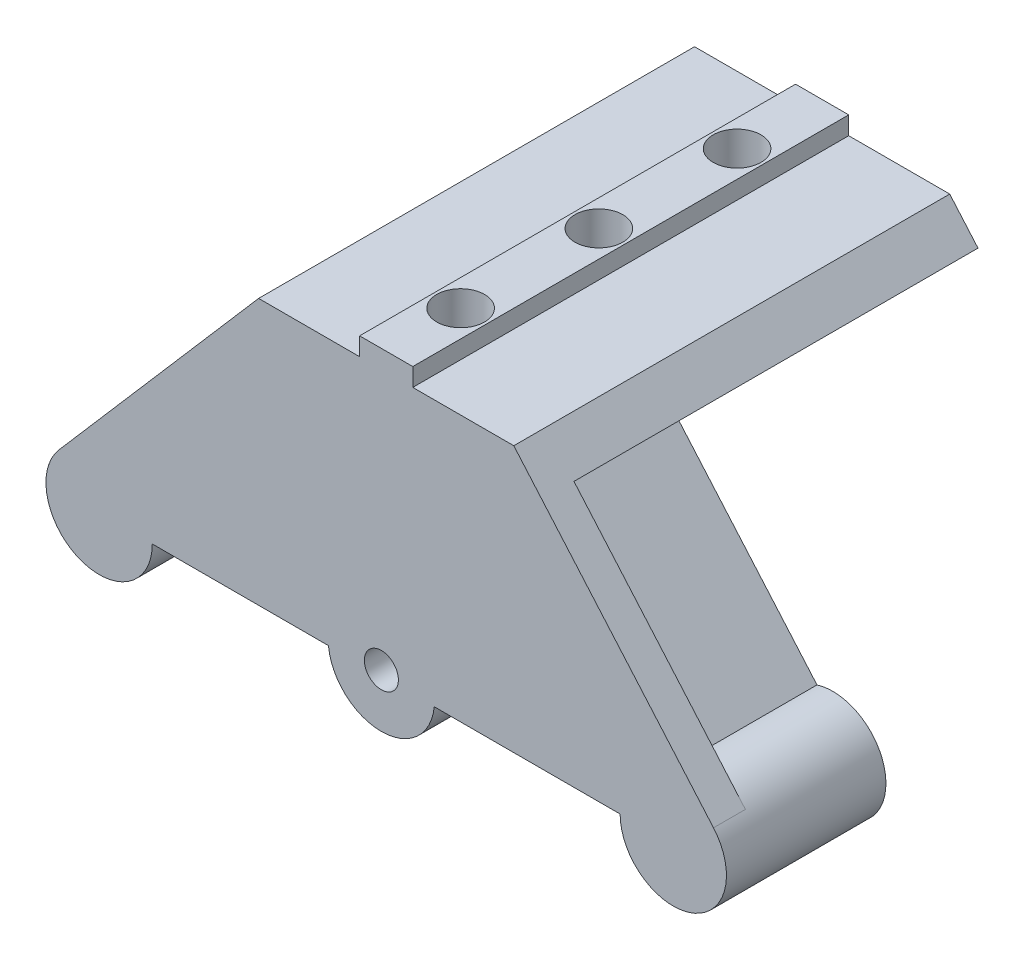
ISO-10303-21;
HEADER;
FILE_DESCRIPTION(('STEP AP214'),'2;1');
FILE_NAME('part.step','',(''),(''),'','','');
FILE_SCHEMA(('AUTOMOTIVE_DESIGN { 1 0 10303 214 1 1 1 1 }'));
ENDSEC;
DATA;
#1=APPLICATION_CONTEXT('core data for automotive mechanical design processes');
#2=APPLICATION_PROTOCOL_DEFINITION('international standard','automotive_design',2000,#1);
#3=PRODUCT_CONTEXT('',#1,'mechanical');
#4=PRODUCT('Part','Part','',(#3));
#5=PRODUCT_RELATED_PRODUCT_CATEGORY('part','',(#4));
#6=PRODUCT_DEFINITION_FORMATION('','',#4);
#7=PRODUCT_DEFINITION_CONTEXT('part definition',#1,'design');
#8=PRODUCT_DEFINITION('design','',#6,#7);
#9=PRODUCT_DEFINITION_SHAPE('','',#8);
#10=(LENGTH_UNIT() NAMED_UNIT(*) SI_UNIT(.MILLI.,.METRE.));
#11=(NAMED_UNIT(*) PLANE_ANGLE_UNIT() SI_UNIT($,.RADIAN.));
#12=(NAMED_UNIT(*) SI_UNIT($,.STERADIAN.) SOLID_ANGLE_UNIT());
#13=UNCERTAINTY_MEASURE_WITH_UNIT(LENGTH_MEASURE(1.E-05),#10,'distance_accuracy_value','');
#14=(GEOMETRIC_REPRESENTATION_CONTEXT(3) GLOBAL_UNCERTAINTY_ASSIGNED_CONTEXT((#13)) GLOBAL_UNIT_ASSIGNED_CONTEXT((#10,
#11,#12)) REPRESENTATION_CONTEXT('',''));
#15=CARTESIAN_POINT('',(0.,0.,0.));
#16=DIRECTION('',(0.,0.,1.));
#17=DIRECTION('',(1.,0.,0.));
#18=AXIS2_PLACEMENT_3D('',#15,#16,#17);
#19=CARTESIAN_POINT('',(-22.,0.,-3.));
#20=DIRECTION('',(0.,-1.,0.));
#21=DIRECTION('',(0.,0.,-1.));
#22=AXIS2_PLACEMENT_3D('',#19,#20,#21);
#23=PLANE('',#22);
#24=DIRECTION('',(0.,0.,1.));
#25=VECTOR('',#24,1.);
#26=CARTESIAN_POINT('',(4.51976416023808,0.,-3.));
#27=LINE('',#26,#25);
#28=CARTESIAN_POINT('',(4.51976416023808,0.,-3.));
#29=VERTEX_POINT('',#28);
#30=CARTESIAN_POINT('',(4.51976416023808,0.,0.));
#31=VERTEX_POINT('',#30);
#32=EDGE_CURVE('E200',#29,#31,#27,.T.);
#33=ORIENTED_EDGE('',*,*,#32,.F.);
#34=DIRECTION('',(1.,0.,0.));
#35=VECTOR('',#34,1.);
#36=CARTESIAN_POINT('',(-22.,0.,-3.));
#37=LINE('',#36,#35);
#38=CARTESIAN_POINT('',(22.,0.,-3.));
#39=VERTEX_POINT('',#38);
#40=EDGE_CURVE('E37',#29,#39,#37,.T.);
#41=ORIENTED_EDGE('',*,*,#40,.T.);
#42=DIRECTION('',(0.,0.,1.));
#43=VECTOR('',#42,1.);
#44=CARTESIAN_POINT('',(22.,0.,-3.));
#45=LINE('',#44,#43);
#46=CARTESIAN_POINT('',(22.,0.,0.));
#47=VERTEX_POINT('',#46);
#48=EDGE_CURVE('E229',#39,#47,#45,.T.);
#49=ORIENTED_EDGE('',*,*,#48,.T.);
#50=DIRECTION('',(1.,0.,0.));
#51=VECTOR('',#50,1.);
#52=CARTESIAN_POINT('',(-22.,0.,0.));
#53=LINE('',#52,#51);
#54=EDGE_CURVE('E267',#31,#47,#53,.T.);
#55=ORIENTED_EDGE('',*,*,#54,.F.);
#56=EDGE_LOOP('',(#33,#41,#49,#55));
#57=FACE_BOUND('',#56,.T.);
#58=ADVANCED_FACE('F33',(#57),#23,.T.);
#59=CARTESIAN_POINT('',(0.,12.,-7.));
#60=DIRECTION('',(0.,1.,0.));
#61=DIRECTION('',(0.,0.,1.));
#62=AXIS2_PLACEMENT_3D('',#59,#60,#61);
#63=CYLINDRICAL_SURFACE('',#62,2.25);
#64=CARTESIAN_POINT('',(0.,26.7,-7.));
#65=DIRECTION('',(0.,1.,0.));
#66=DIRECTION('',(0.,0.,1.));
#67=AXIS2_PLACEMENT_3D('',#64,#65,#66);
#68=CIRCLE('',#67,2.25);
#69=CARTESIAN_POINT('',(0.,26.7,-4.75));
#70=VERTEX_POINT('',#69);
#71=EDGE_CURVE('E451',#70,#70,#68,.T.);
#72=ORIENTED_EDGE('',*,*,#71,.T.);
#73=EDGE_LOOP('',(#72));
#74=FACE_BOUND('',#73,.T.);
#75=CARTESIAN_POINT('',(0.,22.5,-7.));
#76=DIRECTION('',(0.,-1.,0.));
#77=DIRECTION('',(1.,0.,0.));
#78=AXIS2_PLACEMENT_3D('',#75,#76,#77);
#79=CIRCLE('',#78,2.25);
#80=CARTESIAN_POINT('',(2.25,22.5,-7.));
#81=VERTEX_POINT('',#80);
#82=EDGE_CURVE('E461',#81,#81,#79,.F.);
#83=ORIENTED_EDGE('',*,*,#82,.F.);
#84=EDGE_LOOP('',(#83));
#85=FACE_BOUND('',#84,.T.);
#86=ADVANCED_FACE('F568',(#74,#85),#63,.F.);
#87=CARTESIAN_POINT('',(0.,12.,-20.));
#88=DIRECTION('',(0.,1.,0.));
#89=DIRECTION('',(0.,0.,1.));
#90=AXIS2_PLACEMENT_3D('',#87,#88,#89);
#91=CYLINDRICAL_SURFACE('',#90,2.25);
#92=CARTESIAN_POINT('',(0.,26.7,-20.));
#93=DIRECTION('',(0.,1.,0.));
#94=DIRECTION('',(0.,0.,1.));
#95=AXIS2_PLACEMENT_3D('',#92,#93,#94);
#96=CIRCLE('',#95,2.25);
#97=CARTESIAN_POINT('',(0.,26.7,-17.75));
#98=VERTEX_POINT('',#97);
#99=EDGE_CURVE('E448',#98,#98,#96,.T.);
#100=ORIENTED_EDGE('',*,*,#99,.T.);
#101=EDGE_LOOP('',(#100));
#102=FACE_BOUND('',#101,.T.);
#103=CARTESIAN_POINT('',(0.,22.5,-20.));
#104=DIRECTION('',(0.,-1.,0.));
#105=DIRECTION('',(1.,0.,0.));
#106=AXIS2_PLACEMENT_3D('',#103,#104,#105);
#107=CIRCLE('',#106,2.25);
#108=CARTESIAN_POINT('',(2.25,22.5,-20.));
#109=VERTEX_POINT('',#108);
#110=EDGE_CURVE('E458',#109,#109,#107,.F.);
#111=ORIENTED_EDGE('',*,*,#110,.F.);
#112=EDGE_LOOP('',(#111));
#113=FACE_BOUND('',#112,.T.);
#114=ADVANCED_FACE('F573',(#102,#113),#91,.F.);
#115=CARTESIAN_POINT('',(0.,12.,-33.));
#116=DIRECTION('',(0.,1.,0.));
#117=DIRECTION('',(0.,0.,1.));
#118=AXIS2_PLACEMENT_3D('',#115,#116,#117);
#119=CYLINDRICAL_SURFACE('',#118,2.25);
#120=CARTESIAN_POINT('',(0.,26.7,-33.));
#121=DIRECTION('',(0.,1.,0.));
#122=DIRECTION('',(0.,0.,1.));
#123=AXIS2_PLACEMENT_3D('',#120,#121,#122);
#124=CIRCLE('',#123,2.25);
#125=CARTESIAN_POINT('',(0.,26.7,-30.75));
#126=VERTEX_POINT('',#125);
#127=EDGE_CURVE('E443',#126,#126,#124,.T.);
#128=ORIENTED_EDGE('',*,*,#127,.T.);
#129=EDGE_LOOP('',(#128));
#130=FACE_BOUND('',#129,.T.);
#131=CARTESIAN_POINT('',(0.,22.5,-33.));
#132=DIRECTION('',(0.,-1.,0.));
#133=DIRECTION('',(1.,0.,0.));
#134=AXIS2_PLACEMENT_3D('',#131,#132,#133);
#135=CIRCLE('',#134,2.25);
#136=CARTESIAN_POINT('',(2.25,22.5,-33.));
#137=VERTEX_POINT('',#136);
#138=EDGE_CURVE('E454',#137,#137,#135,.F.);
#139=ORIENTED_EDGE('',*,*,#138,.F.);
#140=EDGE_LOOP('',(#139));
#141=FACE_BOUND('',#140,.T.);
#142=ADVANCED_FACE('F660',(#130,#141),#119,.F.);
#143=CARTESIAN_POINT('',(-12.,25.,-3.));
#144=DIRECTION('',(0.,1.,0.));
#145=DIRECTION('',(0.,0.,1.));
#146=AXIS2_PLACEMENT_3D('',#143,#144,#145);
#147=PLANE('',#146);
#148=DIRECTION('',(-1.,0.,0.));
#149=VECTOR('',#148,1.);
#150=CARTESIAN_POINT('',(-12.,25.,0.));
#151=LINE('',#150,#149);
#152=CARTESIAN_POINT('',(-2.5,25.,0.));
#153=VERTEX_POINT('',#152);
#154=CARTESIAN_POINT('',(-12.,25.,0.));
#155=VERTEX_POINT('',#154);
#156=EDGE_CURVE('E277',#153,#155,#151,.T.);
#157=ORIENTED_EDGE('',*,*,#156,.F.);
#158=DIRECTION('',(0.,0.,-1.));
#159=VECTOR('',#158,1.);
#160=CARTESIAN_POINT('',(-2.5,25.,0.));
#161=LINE('',#160,#159);
#162=CARTESIAN_POINT('',(-2.5,25.,-41.));
#163=VERTEX_POINT('',#162);
#164=EDGE_CURVE('E414',#153,#163,#161,.T.);
#165=ORIENTED_EDGE('',*,*,#164,.T.);
#166=DIRECTION('',(1.,0.,0.));
#167=VECTOR('',#166,1.);
#168=CARTESIAN_POINT('',(-12.,25.,-41.));
#169=LINE('',#168,#167);
#170=CARTESIAN_POINT('',(-12.,25.,-41.));
#171=VERTEX_POINT('',#170);
#172=EDGE_CURVE('E546',#171,#163,#169,.T.);
#173=ORIENTED_EDGE('',*,*,#172,.F.);
#174=DIRECTION('',(0.,0.,1.));
#175=VECTOR('',#174,1.);
#176=CARTESIAN_POINT('',(-12.,25.,-3.));
#177=LINE('',#176,#175);
#178=EDGE_CURVE('E215',#171,#155,#177,.T.);
#179=ORIENTED_EDGE('',*,*,#178,.T.);
#180=EDGE_LOOP('',(#157,#165,#173,#179));
#181=FACE_BOUND('',#180,.T.);
#182=ADVANCED_FACE('F641',(#181),#147,.T.);
#183=CARTESIAN_POINT('',(-27.,0.,-15.));
#184=DIRECTION('',(0.,0.,-1.));
#185=DIRECTION('',(-1.,0.,0.));
#186=AXIS2_PLACEMENT_3D('',#183,#184,#185);
#187=PLANE('',#186);
#188=DIRECTION('',(-0.756553330373241,0.653931998223942,0.));
#189=VECTOR('',#188,1.);
#190=CARTESIAN_POINT('',(-14.6591141126405,21.9235919893436,-15.));
#191=LINE('',#190,#189);
#192=CARTESIAN_POINT('',(-10.1197941304011,18.,-15.));
#193=VERTEX_POINT('',#192);
#194=CARTESIAN_POINT('',(-12.3894541215208,19.9617959946718,-15.));
#195=VERTEX_POINT('',#194);
#196=EDGE_CURVE('E314',#193,#195,#191,.T.);
#197=ORIENTED_EDGE('',*,*,#196,.F.);
#198=DIRECTION('',(-0.653931998223943,-0.75655333037324,0.));
#199=VECTOR('',#198,1.);
#200=CARTESIAN_POINT('',(-23.0398472253722,3.05240724701143,-15.));
#201=LINE('',#200,#199);
#202=CARTESIAN_POINT('',(-23.0398472253722,3.05240724701143,-15.));
#203=VERTEX_POINT('',#202);
#204=EDGE_CURVE('E338',#193,#203,#201,.T.);
#205=ORIENTED_EDGE('',*,*,#204,.T.);
#206=CARTESIAN_POINT('',(-27.,0.,-15.));
#207=DIRECTION('',(0.,0.,-1.));
#208=DIRECTION('',(-1.,0.,0.));
#209=AXIS2_PLACEMENT_3D('',#206,#207,#208);
#210=CIRCLE('',#209,4.99999999999997);
#211=CARTESIAN_POINT('',(-25.5164137795315,4.77482690015417,-15.));
#212=VERTEX_POINT('',#211);
#213=EDGE_CURVE('E293',#203,#212,#210,.T.);
#214=ORIENTED_EDGE('',*,*,#213,.T.);
#215=DIRECTION('',(0.653931998223943,0.75655333037324,0.));
#216=VECTOR('',#215,1.);
#217=CARTESIAN_POINT('',(-25.5164137795315,4.77482690015417,-15.));
#218=LINE('',#217,#216);
#219=EDGE_CURVE('E291',#212,#195,#218,.T.);
#220=ORIENTED_EDGE('',*,*,#219,.T.);
#221=EDGE_LOOP('',(#197,#205,#214,#220));
#222=FACE_BOUND('',#221,.T.);
#223=CARTESIAN_POINT('',(-27.,0.,-15.));
#224=DIRECTION('',(0.,0.,-1.));
#225=DIRECTION('',(-1.,0.,0.));
#226=AXIS2_PLACEMENT_3D('',#223,#224,#225);
#227=CIRCLE('',#226,3.39);
#228=CARTESIAN_POINT('',(-30.39,0.,-15.));
#229=VERTEX_POINT('',#228);
#230=EDGE_CURVE('E329',#229,#229,#227,.T.);
#231=ORIENTED_EDGE('',*,*,#230,.F.);
#232=EDGE_LOOP('',(#231));
#233=FACE_BOUND('',#232,.T.);
#234=ADVANCED_FACE('F617',(#222,#233),#187,.T.);
#235=CARTESIAN_POINT('',(27.,0.,-3.));
#236=DIRECTION('',(0.,0.,1.));
#237=DIRECTION('',(1.,0.,0.));
#238=AXIS2_PLACEMENT_3D('',#235,#236,#237);
#239=PLANE('',#238);
#240=DIRECTION('',(-0.756553330373241,0.653931998223942,0.));
#241=VECTOR('',#240,1.);
#242=CARTESIAN_POINT('',(-12.3894541215208,19.9617959946718,-3.));
#243=LINE('',#242,#241);
#244=CARTESIAN_POINT('',(-12.3894541215208,19.9617959946718,-3.));
#245=VERTEX_POINT('',#244);
#246=CARTESIAN_POINT('',(-14.6591141126405,21.9235919893436,-3.));
#247=VERTEX_POINT('',#246);
#248=EDGE_CURVE('E299',#245,#247,#243,.T.);
#249=ORIENTED_EDGE('',*,*,#248,.F.);
#250=DIRECTION('',(0.653931998223943,0.75655333037324,0.));
#251=VECTOR('',#250,1.);
#252=CARTESIAN_POINT('',(-25.5164137795315,4.77482690015417,-3.));
#253=LINE('',#252,#251);
#254=CARTESIAN_POINT('',(-25.5164137795315,4.77482690015417,-3.));
#255=VERTEX_POINT('',#254);
#256=EDGE_CURVE('E352',#255,#245,#253,.T.);
#257=ORIENTED_EDGE('',*,*,#256,.F.);
#258=CARTESIAN_POINT('',(-27.,0.,-3.));
#259=DIRECTION('',(0.,0.,-1.));
#260=DIRECTION('',(-1.,0.,0.));
#261=AXIS2_PLACEMENT_3D('',#258,#259,#260);
#262=CIRCLE('',#261,4.99999999999997);
#263=CARTESIAN_POINT('',(-30.7827666518662,3.26965999111971,-3.));
#264=VERTEX_POINT('',#263);
#265=EDGE_CURVE('E43',#264,#255,#262,.T.);
#266=ORIENTED_EDGE('',*,*,#265,.F.);
#267=DIRECTION('',(-0.653931998223943,-0.75655333037324,0.));
#268=VECTOR('',#267,1.);
#269=CARTESIAN_POINT('',(-12.,25.,-3.));
#270=LINE('',#269,#268);
#271=EDGE_CURVE('E217',#247,#264,#270,.T.);
#272=ORIENTED_EDGE('',*,*,#271,.F.);
#273=EDGE_LOOP('',(#249,#257,#266,#272));
#274=FACE_BOUND('',#273,.T.);
#275=ADVANCED_FACE('F521',(#274),#239,.F.);
#276=CARTESIAN_POINT('',(-0.45563994772233,0.495332173890094,-3.));
#277=DIRECTION('',(0.,0.,1.));
#278=DIRECTION('',(1.,0.,0.));
#279=AXIS2_PLACEMENT_3D('',#276,#277,#278);
#280=CIRCLE('',#279,1.6);
#281=CARTESIAN_POINT('',(1.14436005227767,0.495332173890094,-3.));
#282=VERTEX_POINT('',#281);
#283=EDGE_CURVE('E695',#282,#282,#280,.T.);
#284=ORIENTED_EDGE('',*,*,#283,.T.);
#285=EDGE_LOOP('',(#284));
#286=FACE_BOUND('',#285,.T.);
#287=ORIENTED_EDGE('',*,*,#40,.F.);
#288=CARTESIAN_POINT('',(-0.45563994772233,0.495332173890094,-3.));
#289=DIRECTION('',(0.,0.,1.));
#290=DIRECTION('',(1.,0.,0.));
#291=AXIS2_PLACEMENT_3D('',#288,#289,#290);
#292=CIRCLE('',#291,5.);
#293=CARTESIAN_POINT('',(-5.43104405568274,0.,-3.));
#294=VERTEX_POINT('',#293);
#295=EDGE_CURVE('E195',#294,#29,#292,.T.);
#296=ORIENTED_EDGE('',*,*,#295,.F.);
#297=CARTESIAN_POINT('',(-22.,0.,-3.));
#298=VERTEX_POINT('',#297);
#299=EDGE_CURVE('E206',#298,#294,#37,.T.);
#300=ORIENTED_EDGE('',*,*,#299,.F.);
#301=CARTESIAN_POINT('',(-23.0398472253722,3.05240724701143,-3.));
#302=VERTEX_POINT('',#301);
#303=EDGE_CURVE('E246',#302,#298,#262,.T.);
#304=ORIENTED_EDGE('',*,*,#303,.F.);
#305=DIRECTION('',(-0.653931998223943,-0.75655333037324,0.));
#306=VECTOR('',#305,1.);
#307=CARTESIAN_POINT('',(-23.0398472253722,3.05240724701143,-3.));
#308=LINE('',#307,#306);
#309=CARTESIAN_POINT('',(-10.1197941304011,18.,-3.));
#310=VERTEX_POINT('',#309);
#311=EDGE_CURVE('E349',#310,#302,#308,.T.);
#312=ORIENTED_EDGE('',*,*,#311,.F.);
#313=DIRECTION('',(-1.,0.,0.));
#314=VECTOR('',#313,1.);
#315=CARTESIAN_POINT('',(-10.1197941304011,18.,-3.));
#316=LINE('',#315,#314);
#317=CARTESIAN_POINT('',(0.,18.,-3.));
#318=VERTEX_POINT('',#317);
#319=EDGE_CURVE('E345',#318,#310,#316,.T.);
#320=ORIENTED_EDGE('',*,*,#319,.F.);
#321=CARTESIAN_POINT('',(10.1197941304011,18.,-3.));
#322=VERTEX_POINT('',#321);
#323=EDGE_CURVE('E346',#322,#318,#316,.T.);
#324=ORIENTED_EDGE('',*,*,#323,.F.);
#325=DIRECTION('',(-0.653931998223942,0.756553330373241,0.));
#326=VECTOR('',#325,1.);
#327=CARTESIAN_POINT('',(23.0398472253722,3.05240724701142,-3.));
#328=LINE('',#327,#326);
#329=CARTESIAN_POINT('',(23.0398472253722,3.05240724701142,-3.));
#330=VERTEX_POINT('',#329);
#331=EDGE_CURVE('E244',#330,#322,#328,.T.);
#332=ORIENTED_EDGE('',*,*,#331,.F.);
#333=CARTESIAN_POINT('',(27.,0.,-3.));
#334=DIRECTION('',(0.,0.,-1.));
#335=DIRECTION('',(-1.,0.,0.));
#336=AXIS2_PLACEMENT_3D('',#333,#334,#335);
#337=CIRCLE('',#336,4.99999999999997);
#338=EDGE_CURVE('E223',#39,#330,#337,.T.);
#339=ORIENTED_EDGE('',*,*,#338,.F.);
#340=EDGE_LOOP('',(#287,#296,#300,#304,#312,#320,#324,#332,#339));
#341=FACE_BOUND('',#340,.T.);
#342=ADVANCED_FACE('F205',(#286,#341),#239,.F.);
#343=CARTESIAN_POINT('',(25.5164137795315,4.77482690015416,-3.));
#344=VERTEX_POINT('',#343);
#345=CARTESIAN_POINT('',(30.7827666518662,3.26965999111974,-3.));
#346=VERTEX_POINT('',#345);
#347=EDGE_CURVE('E240',#344,#346,#337,.T.);
#348=ORIENTED_EDGE('',*,*,#347,.F.);
#349=DIRECTION('',(0.653931998223943,-0.75655333037324,0.));
#350=VECTOR('',#349,1.);
#351=CARTESIAN_POINT('',(25.5164137795315,4.77482690015416,-3.));
#352=LINE('',#351,#350);
#353=CARTESIAN_POINT('',(12.3894541215208,19.9617959946718,-3.));
#354=VERTEX_POINT('',#353);
#355=EDGE_CURVE('E245',#354,#344,#352,.T.);
#356=ORIENTED_EDGE('',*,*,#355,.F.);
#357=DIRECTION('',(-0.756553330373241,-0.653931998223942,0.));
#358=VECTOR('',#357,1.);
#359=CARTESIAN_POINT('',(12.3894541215208,19.9617959946718,-3.));
#360=LINE('',#359,#358);
#361=CARTESIAN_POINT('',(14.6591141126405,21.9235919893437,-3.));
#362=VERTEX_POINT('',#361);
#363=EDGE_CURVE('E236',#362,#354,#360,.T.);
#364=ORIENTED_EDGE('',*,*,#363,.F.);
#365=DIRECTION('',(-0.653931998223944,0.756553330373239,0.));
#366=VECTOR('',#365,1.);
#367=CARTESIAN_POINT('',(30.7827666518662,3.26965999111974,-3.));
#368=LINE('',#367,#366);
#369=EDGE_CURVE('E212',#346,#362,#368,.T.);
#370=ORIENTED_EDGE('',*,*,#369,.F.);
#371=EDGE_LOOP('',(#348,#356,#364,#370));
#372=FACE_BOUND('',#371,.T.);
#373=ADVANCED_FACE('F628',(#372),#239,.F.);
#374=DIRECTION('',(0.,0.,-1.));
#375=VECTOR('',#374,1.);
#376=CARTESIAN_POINT('',(2.5,25.,0.));
#377=LINE('',#376,#375);
#378=CARTESIAN_POINT('',(2.5,25.,0.));
#379=VERTEX_POINT('',#378);
#380=CARTESIAN_POINT('',(2.5,25.,-41.));
#381=VERTEX_POINT('',#380);
#382=EDGE_CURVE('E396',#379,#381,#377,.T.);
#383=ORIENTED_EDGE('',*,*,#382,.F.);
#384=CARTESIAN_POINT('',(12.,25.,0.));
#385=VERTEX_POINT('',#384);
#386=EDGE_CURVE('E273',#385,#379,#151,.T.);
#387=ORIENTED_EDGE('',*,*,#386,.F.);
#388=DIRECTION('',(0.,0.,1.));
#389=VECTOR('',#388,1.);
#390=CARTESIAN_POINT('',(12.,25.,-3.));
#391=LINE('',#390,#389);
#392=CARTESIAN_POINT('',(12.,25.,-41.));
#393=VERTEX_POINT('',#392);
#394=EDGE_CURVE('E228',#393,#385,#391,.T.);
#395=ORIENTED_EDGE('',*,*,#394,.F.);
#396=EDGE_CURVE('E550',#381,#393,#169,.T.);
#397=ORIENTED_EDGE('',*,*,#396,.F.);
#398=EDGE_LOOP('',(#383,#387,#395,#397));
#399=FACE_BOUND('',#398,.T.);
#400=ADVANCED_FACE('F35',(#399),#147,.T.);
#401=CARTESIAN_POINT('',(30.7827666518662,3.26965999111974,-3.));
#402=DIRECTION('',(0.756553330373239,0.653931998223944,0.));
#403=DIRECTION('',(-0.653931998223944,0.756553330373239,0.));
#404=AXIS2_PLACEMENT_3D('',#401,#402,#403);
#405=PLANE('',#404);
#406=DIRECTION('',(-0.653931998223944,0.756553330373239,0.));
#407=VECTOR('',#406,1.);
#408=CARTESIAN_POINT('',(30.7827666518662,3.26965999111974,0.));
#409=LINE('',#408,#407);
#410=CARTESIAN_POINT('',(30.7827666518662,3.26965999111974,0.));
#411=VERTEX_POINT('',#410);
#412=EDGE_CURVE('E253',#411,#385,#409,.T.);
#413=ORIENTED_EDGE('',*,*,#412,.F.);
#414=DIRECTION('',(0.,0.,1.));
#415=VECTOR('',#414,1.);
#416=CARTESIAN_POINT('',(30.7827666518662,3.26965999111974,-3.));
#417=LINE('',#416,#415);
#418=EDGE_CURVE('E259',#346,#411,#417,.T.);
#419=ORIENTED_EDGE('',*,*,#418,.F.);
#420=ORIENTED_EDGE('',*,*,#369,.T.);
#421=DIRECTION('',(0.,0.,1.));
#422=VECTOR('',#421,1.);
#423=CARTESIAN_POINT('',(14.6591141126405,21.9235919893436,-15.));
#424=LINE('',#423,#422);
#425=CARTESIAN_POINT('',(14.6591141126405,21.9235919893436,-41.));
#426=VERTEX_POINT('',#425);
#427=EDGE_CURVE('E304',#426,#362,#424,.T.);
#428=ORIENTED_EDGE('',*,*,#427,.F.);
#429=DIRECTION('',(0.653931998223942,-0.756553330373241,0.));
#430=VECTOR('',#429,1.);
#431=CARTESIAN_POINT('',(14.6591141126405,21.9235919893436,-41.));
#432=LINE('',#431,#430);
#433=EDGE_CURVE('E392',#393,#426,#432,.T.);
#434=ORIENTED_EDGE('',*,*,#433,.F.);
#435=ORIENTED_EDGE('',*,*,#394,.T.);
#436=EDGE_LOOP('',(#413,#419,#420,#428,#434,#435));
#437=FACE_BOUND('',#436,.T.);
#438=ADVANCED_FACE('F387',(#437),#405,.T.);
#439=CARTESIAN_POINT('',(27.,0.,-3.));
#440=DIRECTION('',(0.,0.,1.));
#441=DIRECTION('',(1.,0.,0.));
#442=AXIS2_PLACEMENT_3D('',#439,#440,#441);
#443=CYLINDRICAL_SURFACE('',#442,5.00000000000001);
#444=CARTESIAN_POINT('',(27.,0.,0.));
#445=DIRECTION('',(0.,0.,1.));
#446=DIRECTION('',(1.,0.,0.));
#447=AXIS2_PLACEMENT_3D('',#444,#445,#446);
#448=CIRCLE('',#447,5.00000000000001);
#449=EDGE_CURVE('E262',#47,#411,#448,.T.);
#450=ORIENTED_EDGE('',*,*,#449,.F.);
#451=ORIENTED_EDGE('',*,*,#48,.F.);
#452=ORIENTED_EDGE('',*,*,#338,.T.);
#453=DIRECTION('',(0.,0.,1.));
#454=VECTOR('',#453,1.);
#455=CARTESIAN_POINT('',(23.0398472253722,3.05240724701142,-15.));
#456=LINE('',#455,#454);
#457=CARTESIAN_POINT('',(23.0398472253722,3.05240724701142,-15.));
#458=VERTEX_POINT('',#457);
#459=EDGE_CURVE('E501',#458,#330,#456,.T.);
#460=ORIENTED_EDGE('',*,*,#459,.F.);
#461=CARTESIAN_POINT('',(27.,0.,-15.));
#462=DIRECTION('',(0.,0.,-1.));
#463=DIRECTION('',(-1.,0.,0.));
#464=AXIS2_PLACEMENT_3D('',#461,#462,#463);
#465=CIRCLE('',#464,4.99999999999997);
#466=CARTESIAN_POINT('',(25.5164137795315,4.77482690015416,-15.));
#467=VERTEX_POINT('',#466);
#468=EDGE_CURVE('E298',#467,#458,#465,.T.);
#469=ORIENTED_EDGE('',*,*,#468,.F.);
#470=DIRECTION('',(0.,0.,1.));
#471=VECTOR('',#470,1.);
#472=CARTESIAN_POINT('',(25.5164137795315,4.77482690015416,-15.));
#473=LINE('',#472,#471);
#474=EDGE_CURVE('E305',#467,#344,#473,.T.);
#475=ORIENTED_EDGE('',*,*,#474,.T.);
#476=ORIENTED_EDGE('',*,*,#347,.T.);
#477=ORIENTED_EDGE('',*,*,#418,.T.);
#478=EDGE_LOOP('',(#450,#451,#452,#460,#469,#475,#476,#477));
#479=FACE_BOUND('',#478,.T.);
#480=ADVANCED_FACE('F381',(#479),#443,.T.);
#481=DIRECTION('',(0.,0.,1.));
#482=VECTOR('',#481,1.);
#483=CARTESIAN_POINT('',(-5.43104405568274,0.,-3.));
#484=LINE('',#483,#482);
#485=CARTESIAN_POINT('',(-5.43104405568274,0.,0.));
#486=VERTEX_POINT('',#485);
#487=EDGE_CURVE('E192',#486,#294,#484,.F.);
#488=ORIENTED_EDGE('',*,*,#487,.F.);
#489=CARTESIAN_POINT('',(-22.,0.,0.));
#490=VERTEX_POINT('',#489);
#491=EDGE_CURVE('E265',#490,#486,#53,.T.);
#492=ORIENTED_EDGE('',*,*,#491,.F.);
#493=DIRECTION('',(0.,0.,1.));
#494=VECTOR('',#493,1.);
#495=CARTESIAN_POINT('',(-22.,0.,-3.));
#496=LINE('',#495,#494);
#497=EDGE_CURVE('E211',#298,#490,#496,.T.);
#498=ORIENTED_EDGE('',*,*,#497,.F.);
#499=ORIENTED_EDGE('',*,*,#299,.T.);
#500=EDGE_LOOP('',(#488,#492,#498,#499));
#501=FACE_BOUND('',#500,.T.);
#502=ADVANCED_FACE('F210',(#501),#23,.T.);
#503=CARTESIAN_POINT('',(-27.,0.,-3.));
#504=DIRECTION('',(0.,0.,1.));
#505=DIRECTION('',(1.,0.,0.));
#506=AXIS2_PLACEMENT_3D('',#503,#504,#505);
#507=CYLINDRICAL_SURFACE('',#506,4.99999999999998);
#508=CARTESIAN_POINT('',(-27.,0.,0.));
#509=DIRECTION('',(0.,0.,1.));
#510=DIRECTION('',(1.,0.,0.));
#511=AXIS2_PLACEMENT_3D('',#508,#509,#510);
#512=CIRCLE('',#511,4.99999999999998);
#513=CARTESIAN_POINT('',(-30.7827666518662,3.26965999111971,0.));
#514=VERTEX_POINT('',#513);
#515=EDGE_CURVE('E268',#514,#490,#512,.T.);
#516=ORIENTED_EDGE('',*,*,#515,.F.);
#517=DIRECTION('',(0.,0.,1.));
#518=VECTOR('',#517,1.);
#519=CARTESIAN_POINT('',(-30.7827666518662,3.26965999111971,-3.));
#520=LINE('',#519,#518);
#521=EDGE_CURVE('E257',#264,#514,#520,.T.);
#522=ORIENTED_EDGE('',*,*,#521,.F.);
#523=ORIENTED_EDGE('',*,*,#265,.T.);
#524=DIRECTION('',(0.,0.,1.));
#525=VECTOR('',#524,1.);
#526=CARTESIAN_POINT('',(-25.5164137795315,4.77482690015417,-15.));
#527=LINE('',#526,#525);
#528=EDGE_CURVE('E287',#212,#255,#527,.T.);
#529=ORIENTED_EDGE('',*,*,#528,.F.);
#530=ORIENTED_EDGE('',*,*,#213,.F.);
#531=DIRECTION('',(0.,0.,1.));
#532=VECTOR('',#531,1.);
#533=CARTESIAN_POINT('',(-23.0398472253722,3.05240724701143,-15.));
#534=LINE('',#533,#532);
#535=EDGE_CURVE('E508',#203,#302,#534,.T.);
#536=ORIENTED_EDGE('',*,*,#535,.T.);
#537=ORIENTED_EDGE('',*,*,#303,.T.);
#538=ORIENTED_EDGE('',*,*,#497,.T.);
#539=EDGE_LOOP('',(#516,#522,#523,#529,#530,#536,#537,#538));
#540=FACE_BOUND('',#539,.T.);
#541=ADVANCED_FACE('F518',(#540),#507,.T.);
#542=CARTESIAN_POINT('',(-12.,25.,-3.));
#543=DIRECTION('',(-0.75655333037324,0.653931998223943,0.));
#544=DIRECTION('',(-0.653931998223943,-0.75655333037324,0.));
#545=AXIS2_PLACEMENT_3D('',#542,#543,#544);
#546=PLANE('',#545);
#547=DIRECTION('',(-0.653931998223943,-0.75655333037324,0.));
#548=VECTOR('',#547,1.);
#549=CARTESIAN_POINT('',(-12.,25.,0.));
#550=LINE('',#549,#548);
#551=EDGE_CURVE('E271',#155,#514,#550,.T.);
#552=ORIENTED_EDGE('',*,*,#551,.F.);
#553=ORIENTED_EDGE('',*,*,#178,.F.);
#554=DIRECTION('',(0.653931998223942,0.756553330373241,0.));
#555=VECTOR('',#554,1.);
#556=CARTESIAN_POINT('',(-14.6591141126405,21.9235919893436,-41.));
#557=LINE('',#556,#555);
#558=CARTESIAN_POINT('',(-14.6591141126405,21.9235919893436,-41.));
#559=VERTEX_POINT('',#558);
#560=EDGE_CURVE('E318',#559,#171,#557,.T.);
#561=ORIENTED_EDGE('',*,*,#560,.F.);
#562=DIRECTION('',(0.,0.,1.));
#563=VECTOR('',#562,1.);
#564=CARTESIAN_POINT('',(-14.6591141126405,21.9235919893436,-15.));
#565=LINE('',#564,#563);
#566=EDGE_CURVE('E288',#559,#247,#565,.T.);
#567=ORIENTED_EDGE('',*,*,#566,.T.);
#568=ORIENTED_EDGE('',*,*,#271,.T.);
#569=ORIENTED_EDGE('',*,*,#521,.T.);
#570=EDGE_LOOP('',(#552,#553,#561,#567,#568,#569));
#571=FACE_BOUND('',#570,.T.);
#572=ADVANCED_FACE('F524',(#571),#546,.T.);
#573=CARTESIAN_POINT('',(27.,0.,0.));
#574=DIRECTION('',(0.,0.,1.));
#575=DIRECTION('',(1.,0.,0.));
#576=AXIS2_PLACEMENT_3D('',#573,#574,#575);
#577=PLANE('',#576);
#578=CARTESIAN_POINT('',(-0.45563994772233,0.495332173890094,0.));
#579=DIRECTION('',(0.,0.,1.));
#580=DIRECTION('',(1.,0.,0.));
#581=AXIS2_PLACEMENT_3D('',#578,#579,#580);
#582=CIRCLE('',#581,1.6);
#583=CARTESIAN_POINT('',(1.14436005227767,0.495332173890094,0.));
#584=VERTEX_POINT('',#583);
#585=EDGE_CURVE('E698',#584,#584,#582,.T.);
#586=ORIENTED_EDGE('',*,*,#585,.F.);
#587=EDGE_LOOP('',(#586));
#588=FACE_BOUND('',#587,.T.);
#589=ORIENTED_EDGE('',*,*,#491,.T.);
#590=CARTESIAN_POINT('',(-0.45563994772233,0.495332173890094,0.));
#591=DIRECTION('',(0.,0.,1.));
#592=DIRECTION('',(1.,0.,0.));
#593=AXIS2_PLACEMENT_3D('',#590,#591,#592);
#594=CIRCLE('',#593,5.);
#595=EDGE_CURVE('E51',#486,#31,#594,.T.);
#596=ORIENTED_EDGE('',*,*,#595,.T.);
#597=ORIENTED_EDGE('',*,*,#54,.T.);
#598=ORIENTED_EDGE('',*,*,#449,.T.);
#599=ORIENTED_EDGE('',*,*,#412,.T.);
#600=ORIENTED_EDGE('',*,*,#386,.T.);
#601=DIRECTION('',(0.,-1.,0.));
#602=VECTOR('',#601,1.);
#603=CARTESIAN_POINT('',(2.5,25.,0.));
#604=LINE('',#603,#602);
#605=CARTESIAN_POINT('',(2.5,26.7,0.));
#606=VERTEX_POINT('',#605);
#607=EDGE_CURVE('E399',#606,#379,#604,.T.);
#608=ORIENTED_EDGE('',*,*,#607,.F.);
#609=DIRECTION('',(1.,0.,0.));
#610=VECTOR('',#609,1.);
#611=CARTESIAN_POINT('',(2.5,26.7,0.));
#612=LINE('',#611,#610);
#613=CARTESIAN_POINT('',(-2.5,26.7,0.));
#614=VERTEX_POINT('',#613);
#615=EDGE_CURVE('E402',#614,#606,#612,.T.);
#616=ORIENTED_EDGE('',*,*,#615,.F.);
#617=DIRECTION('',(0.,1.,0.));
#618=VECTOR('',#617,1.);
#619=CARTESIAN_POINT('',(-2.5,25.,0.));
#620=LINE('',#619,#618);
#621=EDGE_CURVE('E404',#153,#614,#620,.T.);
#622=ORIENTED_EDGE('',*,*,#621,.F.);
#623=ORIENTED_EDGE('',*,*,#156,.T.);
#624=ORIENTED_EDGE('',*,*,#551,.T.);
#625=ORIENTED_EDGE('',*,*,#515,.T.);
#626=EDGE_LOOP('',(#589,#596,#597,#598,#599,#600,#608,#616,#622,#623,#624,#625));
#627=FACE_BOUND('',#626,.T.);
#628=ADVANCED_FACE('F386',(#588,#627),#577,.T.);
#629=DIRECTION('',(-0.756553330373241,-0.653931998223942,0.));
#630=VECTOR('',#629,1.);
#631=CARTESIAN_POINT('',(10.1197941304011,18.,-15.));
#632=LINE('',#631,#630);
#633=CARTESIAN_POINT('',(12.3894541215208,19.9617959946718,-15.));
#634=VERTEX_POINT('',#633);
#635=CARTESIAN_POINT('',(10.1197941304011,18.,-15.));
#636=VERTEX_POINT('',#635);
#637=EDGE_CURVE('E11',#634,#636,#632,.T.);
#638=ORIENTED_EDGE('',*,*,#637,.F.);
#639=DIRECTION('',(0.653931998223943,-0.75655333037324,0.));
#640=VECTOR('',#639,1.);
#641=CARTESIAN_POINT('',(25.5164137795315,4.77482690015416,-15.));
#642=LINE('',#641,#640);
#643=EDGE_CURVE('E296',#634,#467,#642,.T.);
#644=ORIENTED_EDGE('',*,*,#643,.T.);
#645=ORIENTED_EDGE('',*,*,#468,.T.);
#646=DIRECTION('',(-0.653931998223942,0.756553330373241,0.));
#647=VECTOR('',#646,1.);
#648=CARTESIAN_POINT('',(23.0398472253722,3.05240724701142,-15.));
#649=LINE('',#648,#647);
#650=EDGE_CURVE('E335',#458,#636,#649,.T.);
#651=ORIENTED_EDGE('',*,*,#650,.T.);
#652=EDGE_LOOP('',(#638,#644,#645,#651));
#653=FACE_BOUND('',#652,.T.);
#654=CARTESIAN_POINT('',(27.,0.,-15.));
#655=DIRECTION('',(0.,0.,-1.));
#656=DIRECTION('',(-1.,0.,0.));
#657=AXIS2_PLACEMENT_3D('',#654,#655,#656);
#658=CIRCLE('',#657,3.39);
#659=CARTESIAN_POINT('',(23.61,0.,-15.));
#660=VERTEX_POINT('',#659);
#661=EDGE_CURVE('E322',#660,#660,#658,.T.);
#662=ORIENTED_EDGE('',*,*,#661,.F.);
#663=EDGE_LOOP('',(#662));
#664=FACE_BOUND('',#663,.T.);
#665=ADVANCED_FACE('F590',(#653,#664),#187,.T.);
#666=CARTESIAN_POINT('',(12.3894541215208,19.9617959946718,-15.));
#667=DIRECTION('',(-0.653931998223942,0.756553330373241,0.));
#668=DIRECTION('',(-0.756553330373241,-0.653931998223942,0.));
#669=AXIS2_PLACEMENT_3D('',#666,#667,#668);
#670=PLANE('',#669);
#671=ORIENTED_EDGE('',*,*,#363,.T.);
#672=DIRECTION('',(0.,0.,1.));
#673=VECTOR('',#672,1.);
#674=CARTESIAN_POINT('',(12.3894541215208,19.9617959946718,-15.));
#675=LINE('',#674,#673);
#676=EDGE_CURVE('E302',#634,#354,#675,.T.);
#677=ORIENTED_EDGE('',*,*,#676,.F.);
#678=ORIENTED_EDGE('',*,*,#637,.T.);
#679=DIRECTION('',(0.,0.,1.));
#680=VECTOR('',#679,1.);
#681=CARTESIAN_POINT('',(10.1197941304011,18.,-41.));
#682=LINE('',#681,#680);
#683=CARTESIAN_POINT('',(10.1197941304011,18.,-41.));
#684=VERTEX_POINT('',#683);
#685=EDGE_CURVE('E320',#684,#636,#682,.T.);
#686=ORIENTED_EDGE('',*,*,#685,.F.);
#687=DIRECTION('',(-0.756553330373241,-0.653931998223942,0.));
#688=VECTOR('',#687,1.);
#689=CARTESIAN_POINT('',(10.1197941304011,18.,-41.));
#690=LINE('',#689,#688);
#691=EDGE_CURVE('E541',#426,#684,#690,.T.);
#692=ORIENTED_EDGE('',*,*,#691,.F.);
#693=ORIENTED_EDGE('',*,*,#427,.T.);
#694=EDGE_LOOP('',(#671,#677,#678,#686,#692,#693));
#695=FACE_BOUND('',#694,.T.);
#696=ADVANCED_FACE('F596',(#695),#670,.F.);
#697=CARTESIAN_POINT('',(25.5164137795315,4.77482690015416,-15.));
#698=DIRECTION('',(-0.75655333037324,-0.653931998223943,0.));
#699=DIRECTION('',(0.653931998223943,-0.75655333037324,0.));
#700=AXIS2_PLACEMENT_3D('',#697,#698,#699);
#701=PLANE('',#700);
#702=ORIENTED_EDGE('',*,*,#355,.T.);
#703=ORIENTED_EDGE('',*,*,#474,.F.);
#704=ORIENTED_EDGE('',*,*,#643,.F.);
#705=ORIENTED_EDGE('',*,*,#676,.T.);
#706=EDGE_LOOP('',(#702,#703,#704,#705));
#707=FACE_BOUND('',#706,.T.);
#708=ADVANCED_FACE('F599',(#707),#701,.F.);
#709=CARTESIAN_POINT('',(23.0398472253722,3.05240724701142,-15.));
#710=DIRECTION('',(0.756553330373241,0.653931998223942,0.));
#711=DIRECTION('',(-0.653931998223942,0.756553330373241,0.));
#712=AXIS2_PLACEMENT_3D('',#709,#710,#711);
#713=PLANE('',#712);
#714=ORIENTED_EDGE('',*,*,#331,.T.);
#715=DIRECTION('',(0.,0.,1.));
#716=VECTOR('',#715,1.);
#717=CARTESIAN_POINT('',(10.1197941304011,18.,-15.));
#718=LINE('',#717,#716);
#719=EDGE_CURVE('E495',#636,#322,#718,.T.);
#720=ORIENTED_EDGE('',*,*,#719,.F.);
#721=ORIENTED_EDGE('',*,*,#650,.F.);
#722=ORIENTED_EDGE('',*,*,#459,.T.);
#723=EDGE_LOOP('',(#714,#720,#721,#722));
#724=FACE_BOUND('',#723,.T.);
#725=ADVANCED_FACE('F489',(#724),#713,.F.);
#726=CARTESIAN_POINT('',(-10.1197941304011,18.,-15.));
#727=DIRECTION('',(0.,1.,0.));
#728=DIRECTION('',(-1.,0.,0.));
#729=AXIS2_PLACEMENT_3D('',#726,#727,#728);
#730=PLANE('',#729);
#731=CARTESIAN_POINT('',(0.,18.,-20.));
#732=DIRECTION('',(0.,-1.,0.));
#733=DIRECTION('',(1.,0.,0.));
#734=AXIS2_PLACEMENT_3D('',#731,#732,#733);
#735=CIRCLE('',#734,4.);
#736=CARTESIAN_POINT('',(4.,18.,-20.));
#737=VERTEX_POINT('',#736);
#738=EDGE_CURVE('E463',#737,#737,#735,.T.);
#739=ORIENTED_EDGE('',*,*,#738,.F.);
#740=EDGE_LOOP('',(#739));
#741=FACE_BOUND('',#740,.T.);
#742=CARTESIAN_POINT('',(0.,18.,-33.));
#743=DIRECTION('',(0.,-1.,0.));
#744=DIRECTION('',(1.,0.,0.));
#745=AXIS2_PLACEMENT_3D('',#742,#743,#744);
#746=CIRCLE('',#745,4.);
#747=CARTESIAN_POINT('',(4.,18.,-33.));
#748=VERTEX_POINT('',#747);
#749=EDGE_CURVE('E419',#748,#748,#746,.T.);
#750=ORIENTED_EDGE('',*,*,#749,.F.);
#751=EDGE_LOOP('',(#750));
#752=FACE_BOUND('',#751,.T.);
#753=ORIENTED_EDGE('',*,*,#323,.T.);
#754=CARTESIAN_POINT('',(0.,18.,-7.));
#755=DIRECTION('',(0.,-1.,0.));
#756=DIRECTION('',(1.,0.,0.));
#757=AXIS2_PLACEMENT_3D('',#754,#755,#756);
#758=CIRCLE('',#757,4.);
#759=EDGE_CURVE('E57',#318,#318,#758,.T.);
#760=ORIENTED_EDGE('',*,*,#759,.F.);
#761=ORIENTED_EDGE('',*,*,#319,.T.);
#762=DIRECTION('',(0.,0.,1.));
#763=VECTOR('',#762,1.);
#764=CARTESIAN_POINT('',(-10.1197941304011,18.,-15.));
#765=LINE('',#764,#763);
#766=EDGE_CURVE('E504',#193,#310,#765,.T.);
#767=ORIENTED_EDGE('',*,*,#766,.F.);
#768=DIRECTION('',(0.,0.,1.));
#769=VECTOR('',#768,1.);
#770=CARTESIAN_POINT('',(-10.1197941304011,18.,-41.));
#771=LINE('',#770,#769);
#772=CARTESIAN_POINT('',(-10.1197941304011,18.,-41.));
#773=VERTEX_POINT('',#772);
#774=EDGE_CURVE('E539',#773,#193,#771,.T.);
#775=ORIENTED_EDGE('',*,*,#774,.F.);
#776=DIRECTION('',(-1.,0.,0.));
#777=VECTOR('',#776,1.);
#778=CARTESIAN_POINT('',(-10.1197941304011,18.,-41.));
#779=LINE('',#778,#777);
#780=EDGE_CURVE('E537',#684,#773,#779,.T.);
#781=ORIENTED_EDGE('',*,*,#780,.F.);
#782=ORIENTED_EDGE('',*,*,#685,.T.);
#783=ORIENTED_EDGE('',*,*,#719,.T.);
#784=EDGE_LOOP('',(#753,#760,#761,#767,#775,#781,#782,#783));
#785=FACE_BOUND('',#784,.T.);
#786=ADVANCED_FACE('F485',(#741,#752,#785),#730,.F.);
#787=CARTESIAN_POINT('',(-23.0398472253722,3.05240724701143,-15.));
#788=DIRECTION('',(-0.756553330373241,0.653931998223943,0.));
#789=DIRECTION('',(-0.653931998223943,-0.756553330373241,0.));
#790=AXIS2_PLACEMENT_3D('',#787,#788,#789);
#791=PLANE('',#790);
#792=ORIENTED_EDGE('',*,*,#311,.T.);
#793=ORIENTED_EDGE('',*,*,#535,.F.);
#794=ORIENTED_EDGE('',*,*,#204,.F.);
#795=ORIENTED_EDGE('',*,*,#766,.T.);
#796=EDGE_LOOP('',(#792,#793,#794,#795));
#797=FACE_BOUND('',#796,.T.);
#798=ADVANCED_FACE('F488',(#797),#791,.F.);
#799=CARTESIAN_POINT('',(-25.5164137795315,4.77482690015417,-15.));
#800=DIRECTION('',(0.75655333037324,-0.653931998223943,0.));
#801=DIRECTION('',(0.653931998223943,0.75655333037324,0.));
#802=AXIS2_PLACEMENT_3D('',#799,#800,#801);
#803=PLANE('',#802);
#804=ORIENTED_EDGE('',*,*,#256,.T.);
#805=DIRECTION('',(0.,0.,1.));
#806=VECTOR('',#805,1.);
#807=CARTESIAN_POINT('',(-12.3894541215208,19.9617959946718,-15.));
#808=LINE('',#807,#806);
#809=EDGE_CURVE('E284',#195,#245,#808,.T.);
#810=ORIENTED_EDGE('',*,*,#809,.F.);
#811=ORIENTED_EDGE('',*,*,#219,.F.);
#812=ORIENTED_EDGE('',*,*,#528,.T.);
#813=EDGE_LOOP('',(#804,#810,#811,#812));
#814=FACE_BOUND('',#813,.T.);
#815=ADVANCED_FACE('F516',(#814),#803,.F.);
#816=CARTESIAN_POINT('',(-12.3894541215208,19.9617959946718,-15.));
#817=DIRECTION('',(0.653931998223942,0.756553330373241,0.));
#818=DIRECTION('',(-0.756553330373241,0.653931998223942,0.));
#819=AXIS2_PLACEMENT_3D('',#816,#817,#818);
#820=PLANE('',#819);
#821=ORIENTED_EDGE('',*,*,#248,.T.);
#822=ORIENTED_EDGE('',*,*,#566,.F.);
#823=DIRECTION('',(-0.756553330373241,0.653931998223942,0.));
#824=VECTOR('',#823,1.);
#825=CARTESIAN_POINT('',(-14.6591141126405,21.9235919893436,-41.));
#826=LINE('',#825,#824);
#827=EDGE_CURVE('E532',#773,#559,#826,.T.);
#828=ORIENTED_EDGE('',*,*,#827,.F.);
#829=ORIENTED_EDGE('',*,*,#774,.T.);
#830=ORIENTED_EDGE('',*,*,#196,.T.);
#831=ORIENTED_EDGE('',*,*,#809,.T.);
#832=EDGE_LOOP('',(#821,#822,#828,#829,#830,#831));
#833=FACE_BOUND('',#832,.T.);
#834=ADVANCED_FACE('F530',(#833),#820,.F.);
#835=CARTESIAN_POINT('',(-27.,0.,-15.));
#836=DIRECTION('',(0.,0.,1.));
#837=DIRECTION('',(1.,0.,0.));
#838=AXIS2_PLACEMENT_3D('',#835,#836,#837);
#839=CYLINDRICAL_SURFACE('',#838,3.39);
#840=ORIENTED_EDGE('',*,*,#230,.T.);
#841=EDGE_LOOP('',(#840));
#842=FACE_BOUND('',#841,.T.);
#843=CARTESIAN_POINT('',(-27.,0.,-3.));
#844=DIRECTION('',(0.,0.,-1.));
#845=DIRECTION('',(-1.,0.,0.));
#846=AXIS2_PLACEMENT_3D('',#843,#844,#845);
#847=CIRCLE('',#846,3.39);
#848=CARTESIAN_POINT('',(-30.39,0.,-3.));
#849=VERTEX_POINT('',#848);
#850=EDGE_CURVE('E325',#849,#849,#847,.T.);
#851=ORIENTED_EDGE('',*,*,#850,.F.);
#852=EDGE_LOOP('',(#851));
#853=FACE_BOUND('',#852,.T.);
#854=ADVANCED_FACE('F613',(#842,#853),#839,.F.);
#855=CARTESIAN_POINT('',(27.,0.,-15.));
#856=DIRECTION('',(0.,0.,1.));
#857=DIRECTION('',(1.,0.,0.));
#858=AXIS2_PLACEMENT_3D('',#855,#856,#857);
#859=CYLINDRICAL_SURFACE('',#858,3.39);
#860=ORIENTED_EDGE('',*,*,#661,.T.);
#861=EDGE_LOOP('',(#860));
#862=FACE_BOUND('',#861,.T.);
#863=CARTESIAN_POINT('',(27.,0.,-3.));
#864=DIRECTION('',(0.,0.,-1.));
#865=DIRECTION('',(-1.,0.,0.));
#866=AXIS2_PLACEMENT_3D('',#863,#864,#865);
#867=CIRCLE('',#866,3.39);
#868=CARTESIAN_POINT('',(23.61,0.,-3.));
#869=VERTEX_POINT('',#868);
#870=EDGE_CURVE('E326',#869,#869,#867,.T.);
#871=ORIENTED_EDGE('',*,*,#870,.F.);
#872=EDGE_LOOP('',(#871));
#873=FACE_BOUND('',#872,.T.);
#874=ADVANCED_FACE('F620',(#862,#873),#859,.F.);
#875=ORIENTED_EDGE('',*,*,#850,.T.);
#876=EDGE_LOOP('',(#875));
#877=FACE_BOUND('',#876,.T.);
#878=ADVANCED_FACE('F594',(#877),#239,.F.);
#879=ORIENTED_EDGE('',*,*,#870,.T.);
#880=EDGE_LOOP('',(#879));
#881=FACE_BOUND('',#880,.T.);
#882=ADVANCED_FACE('F564',(#881),#239,.F.);
#883=CARTESIAN_POINT('',(-14.6591141126405,21.9235919893436,-41.));
#884=DIRECTION('',(0.,0.,-1.));
#885=DIRECTION('',(-1.,0.,0.));
#886=AXIS2_PLACEMENT_3D('',#883,#884,#885);
#887=PLANE('',#886);
#888=ORIENTED_EDGE('',*,*,#560,.T.);
#889=ORIENTED_EDGE('',*,*,#172,.T.);
#890=DIRECTION('',(0.,1.,0.));
#891=VECTOR('',#890,1.);
#892=CARTESIAN_POINT('',(-2.5,25.,-41.));
#893=LINE('',#892,#891);
#894=CARTESIAN_POINT('',(-2.5,26.7,-41.));
#895=VERTEX_POINT('',#894);
#896=EDGE_CURVE('E423',#163,#895,#893,.T.);
#897=ORIENTED_EDGE('',*,*,#896,.T.);
#898=DIRECTION('',(1.,0.,0.));
#899=VECTOR('',#898,1.);
#900=CARTESIAN_POINT('',(2.5,26.7,-41.));
#901=LINE('',#900,#899);
#902=CARTESIAN_POINT('',(2.5,26.7,-41.));
#903=VERTEX_POINT('',#902);
#904=EDGE_CURVE('E405',#895,#903,#901,.T.);
#905=ORIENTED_EDGE('',*,*,#904,.T.);
#906=DIRECTION('',(0.,-1.,0.));
#907=VECTOR('',#906,1.);
#908=CARTESIAN_POINT('',(2.5,25.,-41.));
#909=LINE('',#908,#907);
#910=EDGE_CURVE('E440',#903,#381,#909,.T.);
#911=ORIENTED_EDGE('',*,*,#910,.T.);
#912=ORIENTED_EDGE('',*,*,#396,.T.);
#913=ORIENTED_EDGE('',*,*,#433,.T.);
#914=ORIENTED_EDGE('',*,*,#691,.T.);
#915=ORIENTED_EDGE('',*,*,#780,.T.);
#916=ORIENTED_EDGE('',*,*,#827,.T.);
#917=EDGE_LOOP('',(#888,#889,#897,#905,#911,#912,#913,#914,#915,#916));
#918=FACE_BOUND('',#917,.T.);
#919=ADVANCED_FACE('F534',(#918),#887,.T.);
#920=CARTESIAN_POINT('',(2.5,25.,0.));
#921=DIRECTION('',(1.,0.,0.));
#922=DIRECTION('',(0.,0.,-1.));
#923=AXIS2_PLACEMENT_3D('',#920,#921,#922);
#924=PLANE('',#923);
#925=ORIENTED_EDGE('',*,*,#910,.F.);
#926=DIRECTION('',(0.,0.,-1.));
#927=VECTOR('',#926,1.);
#928=CARTESIAN_POINT('',(2.5,26.7,0.));
#929=LINE('',#928,#927);
#930=EDGE_CURVE('E319',#606,#903,#929,.T.);
#931=ORIENTED_EDGE('',*,*,#930,.F.);
#932=ORIENTED_EDGE('',*,*,#607,.T.);
#933=ORIENTED_EDGE('',*,*,#382,.T.);
#934=EDGE_LOOP('',(#925,#931,#932,#933));
#935=FACE_BOUND('',#934,.T.);
#936=ADVANCED_FACE('F554',(#935),#924,.T.);
#937=CARTESIAN_POINT('',(2.5,26.7,0.));
#938=DIRECTION('',(0.,1.,0.));
#939=DIRECTION('',(0.,0.,1.));
#940=AXIS2_PLACEMENT_3D('',#937,#938,#939);
#941=PLANE('',#940);
#942=ORIENTED_EDGE('',*,*,#71,.F.);
#943=EDGE_LOOP('',(#942));
#944=FACE_BOUND('',#943,.T.);
#945=ORIENTED_EDGE('',*,*,#99,.F.);
#946=EDGE_LOOP('',(#945));
#947=FACE_BOUND('',#946,.T.);
#948=ORIENTED_EDGE('',*,*,#127,.F.);
#949=EDGE_LOOP('',(#948));
#950=FACE_BOUND('',#949,.T.);
#951=ORIENTED_EDGE('',*,*,#904,.F.);
#952=DIRECTION('',(0.,0.,-1.));
#953=VECTOR('',#952,1.);
#954=CARTESIAN_POINT('',(-2.5,26.7,0.));
#955=LINE('',#954,#953);
#956=EDGE_CURVE('E411',#614,#895,#955,.T.);
#957=ORIENTED_EDGE('',*,*,#956,.F.);
#958=ORIENTED_EDGE('',*,*,#615,.T.);
#959=ORIENTED_EDGE('',*,*,#930,.T.);
#960=EDGE_LOOP('',(#951,#957,#958,#959));
#961=FACE_BOUND('',#960,.T.);
#962=ADVANCED_FACE('F409',(#944,#947,#950,#961),#941,.T.);
#963=CARTESIAN_POINT('',(-2.5,25.,0.));
#964=DIRECTION('',(-1.,0.,0.));
#965=DIRECTION('',(0.,0.,1.));
#966=AXIS2_PLACEMENT_3D('',#963,#964,#965);
#967=PLANE('',#966);
#968=ORIENTED_EDGE('',*,*,#896,.F.);
#969=ORIENTED_EDGE('',*,*,#164,.F.);
#970=ORIENTED_EDGE('',*,*,#621,.T.);
#971=ORIENTED_EDGE('',*,*,#956,.T.);
#972=EDGE_LOOP('',(#968,#969,#970,#971));
#973=FACE_BOUND('',#972,.T.);
#974=ADVANCED_FACE('F561',(#973),#967,.T.);
#975=CARTESIAN_POINT('',(0.,22.5,-33.));
#976=DIRECTION('',(0.,-1.,0.));
#977=DIRECTION('',(1.,0.,0.));
#978=AXIS2_PLACEMENT_3D('',#975,#976,#977);
#979=PLANE('',#978);
#980=CARTESIAN_POINT('',(0.,22.5,-33.));
#981=DIRECTION('',(0.,-1.,0.));
#982=DIRECTION('',(1.,0.,0.));
#983=AXIS2_PLACEMENT_3D('',#980,#981,#982);
#984=CIRCLE('',#983,4.);
#985=CARTESIAN_POINT('',(4.,22.5,-33.));
#986=VERTEX_POINT('',#985);
#987=EDGE_CURVE('E457',#986,#986,#984,.T.);
#988=ORIENTED_EDGE('',*,*,#987,.T.);
#989=EDGE_LOOP('',(#988));
#990=FACE_BOUND('',#989,.T.);
#991=ORIENTED_EDGE('',*,*,#138,.T.);
#992=EDGE_LOOP('',(#991));
#993=FACE_BOUND('',#992,.T.);
#994=ADVANCED_FACE('F654',(#990,#993),#979,.T.);
#995=CARTESIAN_POINT('',(0.,22.5,-33.));
#996=DIRECTION('',(0.,-1.,0.));
#997=DIRECTION('',(1.,0.,0.));
#998=AXIS2_PLACEMENT_3D('',#995,#996,#997);
#999=CYLINDRICAL_SURFACE('',#998,4.);
#1000=ORIENTED_EDGE('',*,*,#987,.F.);
#1001=EDGE_LOOP('',(#1000));
#1002=FACE_BOUND('',#1001,.T.);
#1003=ORIENTED_EDGE('',*,*,#749,.T.);
#1004=EDGE_LOOP('',(#1003));
#1005=FACE_BOUND('',#1004,.T.);
#1006=ADVANCED_FACE('F483',(#1002,#1005),#999,.F.);
#1007=CARTESIAN_POINT('',(0.,22.5,-20.));
#1008=DIRECTION('',(0.,-1.,0.));
#1009=DIRECTION('',(1.,0.,0.));
#1010=AXIS2_PLACEMENT_3D('',#1007,#1008,#1009);
#1011=PLANE('',#1010);
#1012=CARTESIAN_POINT('',(0.,22.5,-20.));
#1013=DIRECTION('',(0.,-1.,0.));
#1014=DIRECTION('',(1.,0.,0.));
#1015=AXIS2_PLACEMENT_3D('',#1012,#1013,#1014);
#1016=CIRCLE('',#1015,4.);
#1017=CARTESIAN_POINT('',(4.,22.5,-20.));
#1018=VERTEX_POINT('',#1017);
#1019=EDGE_CURVE('E460',#1018,#1018,#1016,.T.);
#1020=ORIENTED_EDGE('',*,*,#1019,.T.);
#1021=EDGE_LOOP('',(#1020));
#1022=FACE_BOUND('',#1021,.T.);
#1023=ORIENTED_EDGE('',*,*,#110,.T.);
#1024=EDGE_LOOP('',(#1023));
#1025=FACE_BOUND('',#1024,.T.);
#1026=ADVANCED_FACE('F668',(#1022,#1025),#1011,.T.);
#1027=CARTESIAN_POINT('',(0.,22.5,-20.));
#1028=DIRECTION('',(0.,-1.,0.));
#1029=DIRECTION('',(1.,0.,0.));
#1030=AXIS2_PLACEMENT_3D('',#1027,#1028,#1029);
#1031=CYLINDRICAL_SURFACE('',#1030,4.);
#1032=ORIENTED_EDGE('',*,*,#1019,.F.);
#1033=EDGE_LOOP('',(#1032));
#1034=FACE_BOUND('',#1033,.T.);
#1035=ORIENTED_EDGE('',*,*,#738,.T.);
#1036=EDGE_LOOP('',(#1035));
#1037=FACE_BOUND('',#1036,.T.);
#1038=ADVANCED_FACE('F671',(#1034,#1037),#1031,.F.);
#1039=CARTESIAN_POINT('',(0.,22.5,-7.));
#1040=DIRECTION('',(0.,-1.,0.));
#1041=DIRECTION('',(1.,0.,0.));
#1042=AXIS2_PLACEMENT_3D('',#1039,#1040,#1041);
#1043=PLANE('',#1042);
#1044=CARTESIAN_POINT('',(0.,22.5,-7.));
#1045=DIRECTION('',(0.,-1.,0.));
#1046=DIRECTION('',(1.,0.,0.));
#1047=AXIS2_PLACEMENT_3D('',#1044,#1045,#1046);
#1048=CIRCLE('',#1047,4.);
#1049=CARTESIAN_POINT('',(4.,22.5,-7.));
#1050=VERTEX_POINT('',#1049);
#1051=EDGE_CURVE('E464',#1050,#1050,#1048,.T.);
#1052=ORIENTED_EDGE('',*,*,#1051,.T.);
#1053=EDGE_LOOP('',(#1052));
#1054=FACE_BOUND('',#1053,.T.);
#1055=ORIENTED_EDGE('',*,*,#82,.T.);
#1056=EDGE_LOOP('',(#1055));
#1057=FACE_BOUND('',#1056,.T.);
#1058=ADVANCED_FACE('F674',(#1054,#1057),#1043,.T.);
#1059=CARTESIAN_POINT('',(0.,22.5,-7.));
#1060=DIRECTION('',(0.,-1.,0.));
#1061=DIRECTION('',(1.,0.,0.));
#1062=AXIS2_PLACEMENT_3D('',#1059,#1060,#1061);
#1063=CYLINDRICAL_SURFACE('',#1062,4.);
#1064=ORIENTED_EDGE('',*,*,#1051,.F.);
#1065=EDGE_LOOP('',(#1064));
#1066=FACE_BOUND('',#1065,.T.);
#1067=ORIENTED_EDGE('',*,*,#759,.T.);
#1068=EDGE_LOOP('',(#1067));
#1069=FACE_BOUND('',#1068,.T.);
#1070=ADVANCED_FACE('F679',(#1066,#1069),#1063,.F.);
#1071=CARTESIAN_POINT('',(-0.45563994772233,0.495332173890094,-3.));
#1072=DIRECTION('',(0.,0.,1.));
#1073=DIRECTION('',(1.,0.,0.));
#1074=AXIS2_PLACEMENT_3D('',#1071,#1072,#1073);
#1075=CYLINDRICAL_SURFACE('',#1074,5.);
#1076=ORIENTED_EDGE('',*,*,#295,.T.);
#1077=ORIENTED_EDGE('',*,*,#32,.T.);
#1078=ORIENTED_EDGE('',*,*,#595,.F.);
#1079=ORIENTED_EDGE('',*,*,#487,.T.);
#1080=EDGE_LOOP('',(#1076,#1077,#1078,#1079));
#1081=FACE_BOUND('',#1080,.T.);
#1082=ADVANCED_FACE('F194',(#1081),#1075,.T.);
#1083=CARTESIAN_POINT('',(-0.45563994772233,0.495332173890094,-3.));
#1084=DIRECTION('',(0.,0.,1.));
#1085=DIRECTION('',(1.,0.,0.));
#1086=AXIS2_PLACEMENT_3D('',#1083,#1084,#1085);
#1087=CYLINDRICAL_SURFACE('',#1086,1.6);
#1088=ORIENTED_EDGE('',*,*,#283,.F.);
#1089=EDGE_LOOP('',(#1088));
#1090=FACE_BOUND('',#1089,.T.);
#1091=ORIENTED_EDGE('',*,*,#585,.T.);
#1092=EDGE_LOOP('',(#1091));
#1093=FACE_BOUND('',#1092,.T.);
#1094=ADVANCED_FACE('F687',(#1090,#1093),#1087,.F.);
#1095=CLOSED_SHELL('',(#58,#86,#114,#142,#182,#234,#275,#342,#373,#400,#438,#480,#502,#541,#572,
#628,#665,#696,#708,#725,#786,#798,#815,#834,#854,#874,#878,#882,#919,#936,#962,#974,#994,#1006,
#1026,#1038,#1058,#1070,#1082,#1094));
#1096=MANIFOLD_SOLID_BREP('B2',#1095);
#1097=ADVANCED_BREP_SHAPE_REPRESENTATION('',(#18,#1096),#14);
#1098=SHAPE_DEFINITION_REPRESENTATION(#9,#1097);
ENDSEC;
END-ISO-10303-21;
